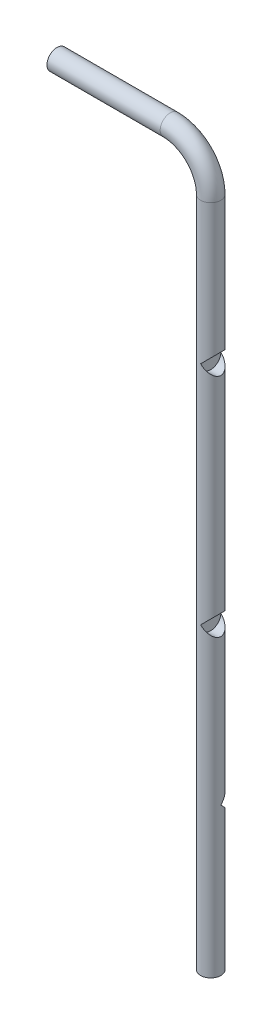
ISO-10303-21;
HEADER;
FILE_DESCRIPTION(('STEP AP214'),'2;1');
FILE_NAME('part.step','',(''),(''),'','','');
FILE_SCHEMA(('AUTOMOTIVE_DESIGN { 1 0 10303 214 1 1 1 1 }'));
ENDSEC;
DATA;
#1=APPLICATION_CONTEXT('core data for automotive mechanical design processes');
#2=APPLICATION_PROTOCOL_DEFINITION('international standard','automotive_design',2000,#1);
#3=PRODUCT_CONTEXT('',#1,'mechanical');
#4=PRODUCT('Part','Part','',(#3));
#5=PRODUCT_RELATED_PRODUCT_CATEGORY('part','',(#4));
#6=PRODUCT_DEFINITION_FORMATION('','',#4);
#7=PRODUCT_DEFINITION_CONTEXT('part definition',#1,'design');
#8=PRODUCT_DEFINITION('design','',#6,#7);
#9=PRODUCT_DEFINITION_SHAPE('','',#8);
#10=(LENGTH_UNIT() NAMED_UNIT(*) SI_UNIT(.MILLI.,.METRE.));
#11=(NAMED_UNIT(*) PLANE_ANGLE_UNIT() SI_UNIT($,.RADIAN.));
#12=(NAMED_UNIT(*) SI_UNIT($,.STERADIAN.) SOLID_ANGLE_UNIT());
#13=UNCERTAINTY_MEASURE_WITH_UNIT(LENGTH_MEASURE(1.E-05),#10,'distance_accuracy_value','');
#14=(GEOMETRIC_REPRESENTATION_CONTEXT(3) GLOBAL_UNCERTAINTY_ASSIGNED_CONTEXT((#13)) GLOBAL_UNIT_ASSIGNED_CONTEXT((#10,
#11,#12)) REPRESENTATION_CONTEXT('',''));
#15=CARTESIAN_POINT('',(0.,0.,0.));
#16=DIRECTION('',(0.,0.,1.));
#17=DIRECTION('',(1.,0.,0.));
#18=AXIS2_PLACEMENT_3D('',#15,#16,#17);
#19=CARTESIAN_POINT('',(0.,0.,0.));
#20=DIRECTION('',(0.,1.,0.));
#21=DIRECTION('',(0.,0.,1.));
#22=AXIS2_PLACEMENT_3D('',#19,#20,#21);
#23=CYLINDRICAL_SURFACE('',#22,12.5);
#24=CARTESIAN_POINT('',(0.,182.5,0.));
#25=DIRECTION('',(0.,0.707106781186547,-0.707106781186547));
#26=DIRECTION('',(0.,0.707106781186547,0.707106781186547));
#27=AXIS2_PLACEMENT_3D('',#24,#25,#26);
#28=ELLIPSE('',#27,17.6776695296637,12.5);
#29=CARTESIAN_POINT('',(-12.5,182.5,0.));
#30=VERTEX_POINT('',#29);
#31=CARTESIAN_POINT('',(12.5,182.5,0.));
#32=VERTEX_POINT('',#31);
#33=EDGE_CURVE('E60',#30,#32,#28,.F.);
#34=ORIENTED_EDGE('',*,*,#33,.T.);
#35=CARTESIAN_POINT('',(0.,182.5,0.));
#36=DIRECTION('',(0.,0.707106781186547,0.707106781186547));
#37=DIRECTION('',(0.,0.707106781186547,-0.707106781186547));
#38=AXIS2_PLACEMENT_3D('',#35,#36,#37);
#39=ELLIPSE('',#38,17.6776695296637,12.5);
#40=EDGE_CURVE('E12',#32,#30,#39,.T.);
#41=ORIENTED_EDGE('',*,*,#40,.T.);
#42=EDGE_LOOP('',(#34,#41));
#43=FACE_BOUND('',#42,.T.);
#44=CARTESIAN_POINT('',(0.,375.5,0.));
#45=DIRECTION('',(-0.707106781186547,0.707106781186547,0.));
#46=DIRECTION('',(0.707106781186547,0.707106781186547,0.));
#47=AXIS2_PLACEMENT_3D('',#44,#45,#46);
#48=ELLIPSE('',#47,17.6776695296637,12.5);
#49=CARTESIAN_POINT('',(0.,375.5,-12.5));
#50=VERTEX_POINT('',#49);
#51=CARTESIAN_POINT('',(0.,375.5,12.5));
#52=VERTEX_POINT('',#51);
#53=EDGE_CURVE('E109',#50,#52,#48,.F.);
#54=ORIENTED_EDGE('',*,*,#53,.F.);
#55=CARTESIAN_POINT('',(0.,375.5,0.));
#56=DIRECTION('',(0.707106781186547,0.707106781186547,0.));
#57=DIRECTION('',(-0.707106781186547,0.707106781186547,0.));
#58=AXIS2_PLACEMENT_3D('',#55,#56,#57);
#59=ELLIPSE('',#58,17.6776695296637,12.5);
#60=EDGE_CURVE('E130',#52,#50,#59,.T.);
#61=ORIENTED_EDGE('',*,*,#60,.F.);
#62=EDGE_LOOP('',(#54,#61));
#63=FACE_BOUND('',#62,.T.);
#64=CARTESIAN_POINT('',(0.,830.,0.));
#65=DIRECTION('',(0.,-1.,0.));
#66=DIRECTION('',(0.,0.,-1.));
#67=AXIS2_PLACEMENT_3D('',#64,#65,#66);
#68=CIRCLE('',#67,12.5);
#69=CARTESIAN_POINT('',(12.5000000000002,830.,0.));
#70=VERTEX_POINT('',#69);
#71=EDGE_CURVE('E113',#70,#70,#68,.T.);
#72=ORIENTED_EDGE('',*,*,#71,.T.);
#73=EDGE_LOOP('',(#72));
#74=FACE_BOUND('',#73,.T.);
#75=CARTESIAN_POINT('',(0.,0.,0.));
#76=DIRECTION('',(0.,-1.,0.));
#77=DIRECTION('',(0.,0.,-1.));
#78=AXIS2_PLACEMENT_3D('',#75,#76,#77);
#79=CIRCLE('',#78,12.5);
#80=CARTESIAN_POINT('',(0.,0.,-12.5));
#81=VERTEX_POINT('',#80);
#82=EDGE_CURVE('E117',#81,#81,#79,.T.);
#83=ORIENTED_EDGE('',*,*,#82,.F.);
#84=EDGE_LOOP('',(#83));
#85=FACE_BOUND('',#84,.T.);
#86=CARTESIAN_POINT('',(0.,655.01,0.));
#87=DIRECTION('',(-0.707106781186547,0.707106781186547,0.));
#88=DIRECTION('',(0.707106781186547,0.707106781186547,0.));
#89=AXIS2_PLACEMENT_3D('',#86,#87,#88);
#90=ELLIPSE('',#89,17.6776695296637,12.5);
#91=CARTESIAN_POINT('',(0.,655.01,-12.5));
#92=VERTEX_POINT('',#91);
#93=CARTESIAN_POINT('',(0.,655.01,12.5));
#94=VERTEX_POINT('',#93);
#95=EDGE_CURVE('E93',#92,#94,#90,.F.);
#96=ORIENTED_EDGE('',*,*,#95,.F.);
#97=CARTESIAN_POINT('',(0.,655.01,0.));
#98=DIRECTION('',(0.707106781186547,0.707106781186547,0.));
#99=DIRECTION('',(-0.707106781186547,0.707106781186547,0.));
#100=AXIS2_PLACEMENT_3D('',#97,#98,#99);
#101=ELLIPSE('',#100,17.6776695296637,12.5);
#102=EDGE_CURVE('E121',#94,#92,#101,.T.);
#103=ORIENTED_EDGE('',*,*,#102,.F.);
#104=EDGE_LOOP('',(#96,#103));
#105=FACE_BOUND('',#104,.T.);
#106=ADVANCED_FACE('F51',(#43,#63,#74,#85,#105),#23,.T.);
#107=CARTESIAN_POINT('',(0.,0.,0.));
#108=DIRECTION('',(0.,-1.,0.));
#109=DIRECTION('',(0.,0.,-1.));
#110=AXIS2_PLACEMENT_3D('',#107,#108,#109);
#111=PLANE('',#110);
#112=ORIENTED_EDGE('',*,*,#82,.T.);
#113=EDGE_LOOP('',(#112));
#114=FACE_BOUND('',#113,.T.);
#115=ADVANCED_FACE('F53',(#114),#111,.T.);
#116=CARTESIAN_POINT('',(-190.,880.,0.));
#117=DIRECTION('',(1.,0.,0.));
#118=DIRECTION('',(0.,0.,-1.));
#119=AXIS2_PLACEMENT_3D('',#116,#117,#118);
#120=PLANE('',#119);
#121=CARTESIAN_POINT('',(-190.,880.,0.));
#122=DIRECTION('',(1.,0.,0.));
#123=DIRECTION('',(0.,0.,-1.));
#124=AXIS2_PLACEMENT_3D('',#121,#122,#123);
#125=CIRCLE('',#124,12.5);
#126=CARTESIAN_POINT('',(-190.,880.,-12.5));
#127=VERTEX_POINT('',#126);
#128=EDGE_CURVE('E133',#127,#127,#125,.T.);
#129=ORIENTED_EDGE('',*,*,#128,.F.);
#130=EDGE_LOOP('',(#129));
#131=FACE_BOUND('',#130,.T.);
#132=ADVANCED_FACE('F175',(#131),#120,.F.);
#133=CARTESIAN_POINT('',(-50.,830.,0.));
#134=DIRECTION('',(0.,0.,1.));
#135=DIRECTION('',(1.,0.,0.));
#136=AXIS2_PLACEMENT_3D('',#133,#134,#135);
#137=TOROIDAL_SURFACE('',#136,50.0000000000002,12.5);
#138=CARTESIAN_POINT('',(-50.0000000000012,880.,0.));
#139=DIRECTION('',(1.,0.,0.));
#140=DIRECTION('',(0.,0.,-1.));
#141=AXIS2_PLACEMENT_3D('',#138,#139,#140);
#142=CIRCLE('',#141,12.5);
#143=CARTESIAN_POINT('',(-50.0000000000014,892.5,0.));
#144=VERTEX_POINT('',#143);
#145=EDGE_CURVE('E137',#144,#144,#142,.T.);
#146=CARTESIAN_POINT('',(-50.,830.,0.));
#147=DIRECTION('',(0.,0.,1.));
#148=DIRECTION('',(1.,0.,0.));
#149=AXIS2_PLACEMENT_3D('',#146,#147,#148);
#150=CIRCLE('',#149,62.5000000000002);
#151=EDGE_CURVE('',#70,#144,#150,.T.);
#152=ORIENTED_EDGE('',*,*,#71,.F.);
#153=ORIENTED_EDGE('',*,*,#145,.T.);
#154=ORIENTED_EDGE('',*,*,#151,.T.);
#155=ORIENTED_EDGE('',*,*,#151,.F.);
#156=EDGE_LOOP('',(#152,#154,#153,#155));
#157=FACE_BOUND('',#156,.T.);
#158=ADVANCED_FACE('F172',(#157),#137,.T.);
#159=CARTESIAN_POINT('',(-50.,880.,0.));
#160=DIRECTION('',(-1.,0.,0.));
#161=DIRECTION('',(0.,-1.,0.));
#162=AXIS2_PLACEMENT_3D('',#159,#160,#161);
#163=CYLINDRICAL_SURFACE('',#162,12.5);
#164=ORIENTED_EDGE('',*,*,#128,.T.);
#165=EDGE_LOOP('',(#164));
#166=FACE_BOUND('',#165,.T.);
#167=ORIENTED_EDGE('',*,*,#145,.F.);
#168=EDGE_LOOP('',(#167));
#169=FACE_BOUND('',#168,.T.);
#170=ADVANCED_FACE('F104',(#166,#169),#163,.T.);
#171=CARTESIAN_POINT('',(21.,375.5,0.));
#172=DIRECTION('',(-1.,0.,0.));
#173=DIRECTION('',(0.,0.,1.));
#174=AXIS2_PLACEMENT_3D('',#171,#172,#173);
#175=CYLINDRICAL_SURFACE('',#174,12.5);
#176=ORIENTED_EDGE('',*,*,#53,.T.);
#177=CARTESIAN_POINT('',(0.,375.5,0.));
#178=DIRECTION('',(1.,0.,0.));
#179=DIRECTION('',(0.,0.,-1.));
#180=AXIS2_PLACEMENT_3D('',#177,#178,#179);
#181=CIRCLE('',#180,12.5);
#182=EDGE_CURVE('E145',#50,#52,#181,.T.);
#183=ORIENTED_EDGE('',*,*,#182,.F.);
#184=EDGE_LOOP('',(#176,#183));
#185=FACE_BOUND('',#184,.T.);
#186=ADVANCED_FACE('F168',(#185),#175,.F.);
#187=ORIENTED_EDGE('',*,*,#60,.T.);
#188=EDGE_CURVE('E100',#52,#50,#181,.T.);
#189=ORIENTED_EDGE('',*,*,#188,.F.);
#190=EDGE_LOOP('',(#187,#189));
#191=FACE_BOUND('',#190,.T.);
#192=ADVANCED_FACE('F162',(#191),#175,.F.);
#193=CARTESIAN_POINT('',(0.,375.5,0.));
#194=DIRECTION('',(1.,0.,0.));
#195=DIRECTION('',(0.,0.,-1.));
#196=AXIS2_PLACEMENT_3D('',#193,#194,#195);
#197=PLANE('',#196);
#198=ORIENTED_EDGE('',*,*,#182,.T.);
#199=ORIENTED_EDGE('',*,*,#188,.T.);
#200=EDGE_LOOP('',(#198,#199));
#201=FACE_BOUND('',#200,.T.);
#202=ADVANCED_FACE('F156',(#201),#197,.T.);
#203=CARTESIAN_POINT('',(21.,655.01,0.));
#204=DIRECTION('',(-1.,0.,0.));
#205=DIRECTION('',(0.,0.,1.));
#206=AXIS2_PLACEMENT_3D('',#203,#204,#205);
#207=CYLINDRICAL_SURFACE('',#206,12.5);
#208=ORIENTED_EDGE('',*,*,#95,.T.);
#209=CARTESIAN_POINT('',(0.,655.01,0.));
#210=DIRECTION('',(1.,0.,0.));
#211=DIRECTION('',(0.,0.,-1.));
#212=AXIS2_PLACEMENT_3D('',#209,#210,#211);
#213=CIRCLE('',#212,12.5);
#214=EDGE_CURVE('E73',#92,#94,#213,.T.);
#215=ORIENTED_EDGE('',*,*,#214,.F.);
#216=EDGE_LOOP('',(#208,#215));
#217=FACE_BOUND('',#216,.T.);
#218=ADVANCED_FACE('F153',(#217),#207,.F.);
#219=ORIENTED_EDGE('',*,*,#102,.T.);
#220=EDGE_CURVE('E148',#94,#92,#213,.T.);
#221=ORIENTED_EDGE('',*,*,#220,.F.);
#222=EDGE_LOOP('',(#219,#221));
#223=FACE_BOUND('',#222,.T.);
#224=ADVANCED_FACE('F155',(#223),#207,.F.);
#225=CARTESIAN_POINT('',(0.,655.01,0.));
#226=DIRECTION('',(1.,0.,0.));
#227=DIRECTION('',(0.,0.,-1.));
#228=AXIS2_PLACEMENT_3D('',#225,#226,#227);
#229=PLANE('',#228);
#230=ORIENTED_EDGE('',*,*,#214,.T.);
#231=ORIENTED_EDGE('',*,*,#220,.T.);
#232=EDGE_LOOP('',(#230,#231));
#233=FACE_BOUND('',#232,.T.);
#234=ADVANCED_FACE('F151',(#233),#229,.T.);
#235=CARTESIAN_POINT('',(0.,182.5,-13.));
#236=DIRECTION('',(0.,0.,1.));
#237=DIRECTION('',(1.,0.,0.));
#238=AXIS2_PLACEMENT_3D('',#235,#236,#237);
#239=CYLINDRICAL_SURFACE('',#238,12.5);
#240=CARTESIAN_POINT('',(0.,182.5,0.));
#241=DIRECTION('',(0.,0.,1.));
#242=DIRECTION('',(1.,0.,0.));
#243=AXIS2_PLACEMENT_3D('',#240,#241,#242);
#244=CIRCLE('',#243,12.5);
#245=EDGE_CURVE('E66',#32,#30,#244,.T.);
#246=ORIENTED_EDGE('',*,*,#245,.T.);
#247=ORIENTED_EDGE('',*,*,#40,.F.);
#248=EDGE_LOOP('',(#246,#247));
#249=FACE_BOUND('',#248,.T.);
#250=ADVANCED_FACE('F98',(#249),#239,.F.);
#251=EDGE_CURVE('E89',#30,#32,#244,.T.);
#252=ORIENTED_EDGE('',*,*,#251,.T.);
#253=ORIENTED_EDGE('',*,*,#33,.F.);
#254=EDGE_LOOP('',(#252,#253));
#255=FACE_BOUND('',#254,.T.);
#256=ADVANCED_FACE('F88',(#255),#239,.F.);
#257=CARTESIAN_POINT('',(0.,182.5,0.));
#258=DIRECTION('',(0.,0.,1.));
#259=DIRECTION('',(1.,0.,0.));
#260=AXIS2_PLACEMENT_3D('',#257,#258,#259);
#261=PLANE('',#260);
#262=ORIENTED_EDGE('',*,*,#245,.F.);
#263=ORIENTED_EDGE('',*,*,#251,.F.);
#264=EDGE_LOOP('',(#262,#263));
#265=FACE_BOUND('',#264,.T.);
#266=ADVANCED_FACE('F94',(#265),#261,.F.);
#267=CLOSED_SHELL('',(#106,#115,#132,#158,#170,#186,#192,#202,#218,#224,#234,#250,#256,#266));
#268=MANIFOLD_SOLID_BREP('B2',#267);
#269=ADVANCED_BREP_SHAPE_REPRESENTATION('',(#18,#268),#14);
#270=SHAPE_DEFINITION_REPRESENTATION(#9,#269);
ENDSEC;
END-ISO-10303-21;
